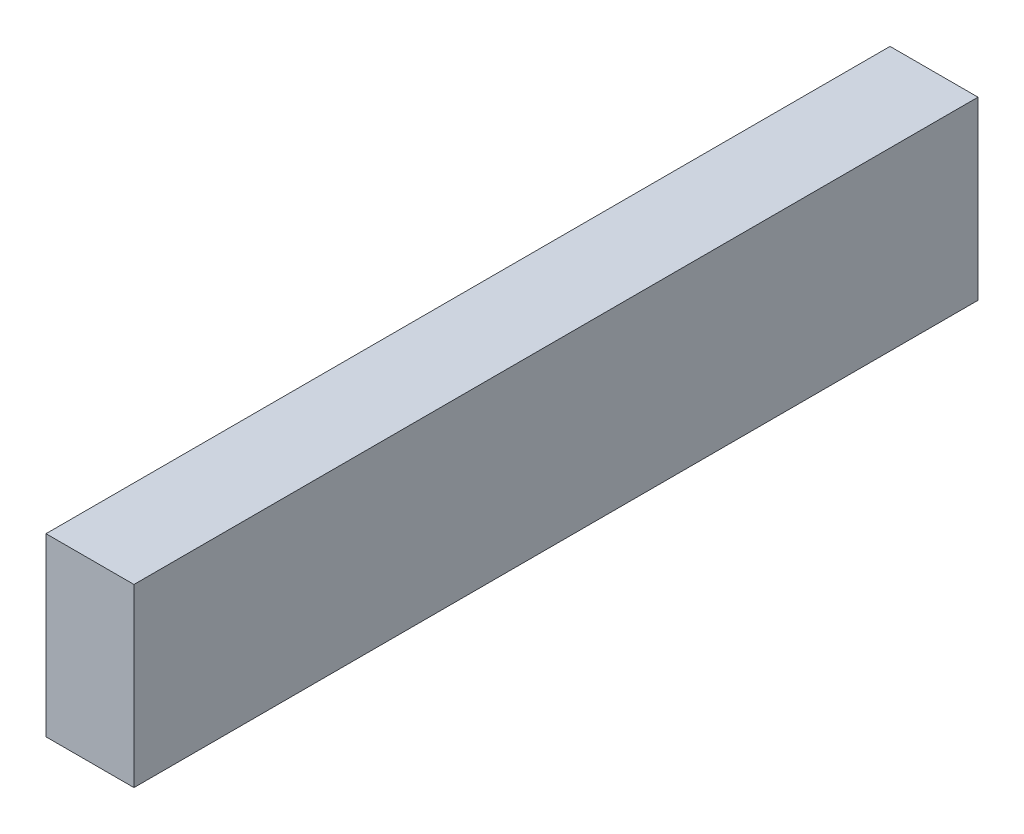
ISO-10303-21;
HEADER;
FILE_DESCRIPTION(('STEP AP214'),'2;1');
FILE_NAME('part.step','',(''),(''),'','','');
FILE_SCHEMA(('AUTOMOTIVE_DESIGN { 1 0 10303 214 1 1 1 1 }'));
ENDSEC;
DATA;
#1=APPLICATION_CONTEXT('core data for automotive mechanical design processes');
#2=APPLICATION_PROTOCOL_DEFINITION('international standard','automotive_design',2000,#1);
#3=PRODUCT_CONTEXT('',#1,'mechanical');
#4=PRODUCT('Part','Part','',(#3));
#5=PRODUCT_RELATED_PRODUCT_CATEGORY('part','',(#4));
#6=PRODUCT_DEFINITION_FORMATION('','',#4);
#7=PRODUCT_DEFINITION_CONTEXT('part definition',#1,'design');
#8=PRODUCT_DEFINITION('design','',#6,#7);
#9=PRODUCT_DEFINITION_SHAPE('','',#8);
#10=(LENGTH_UNIT() NAMED_UNIT(*) SI_UNIT(.MILLI.,.METRE.));
#11=(NAMED_UNIT(*) PLANE_ANGLE_UNIT() SI_UNIT($,.RADIAN.));
#12=(NAMED_UNIT(*) SI_UNIT($,.STERADIAN.) SOLID_ANGLE_UNIT());
#13=UNCERTAINTY_MEASURE_WITH_UNIT(LENGTH_MEASURE(1.E-05),#10,'distance_accuracy_value','');
#14=(GEOMETRIC_REPRESENTATION_CONTEXT(3) GLOBAL_UNCERTAINTY_ASSIGNED_CONTEXT((#13)) GLOBAL_UNIT_ASSIGNED_CONTEXT((#10,
#11,#12)) REPRESENTATION_CONTEXT('',''));
#15=CARTESIAN_POINT('',(0.,0.,0.));
#16=DIRECTION('',(0.,0.,1.));
#17=DIRECTION('',(1.,0.,0.));
#18=AXIS2_PLACEMENT_3D('',#15,#16,#17);
#19=CARTESIAN_POINT('',(19.05,28.2345614501132,39.709945146379));
#20=DIRECTION('',(0.,0.,-1.));
#21=DIRECTION('',(-1.,0.,0.));
#22=AXIS2_PLACEMENT_3D('',#19,#20,#21);
#23=PLANE('',#22);
#24=DIRECTION('',(0.,-1.,0.));
#25=VECTOR('',#24,1.);
#26=CARTESIAN_POINT('',(0.,28.2345614501132,39.709945146379));
#27=LINE('',#26,#25);
#28=CARTESIAN_POINT('',(0.,28.2345614501132,39.709945146379));
#29=VERTEX_POINT('',#28);
#30=CARTESIAN_POINT('',(0.,-9.86543854988684,39.709945146379));
#31=VERTEX_POINT('',#30);
#32=EDGE_CURVE('E107',#29,#31,#27,.T.);
#33=ORIENTED_EDGE('',*,*,#32,.T.);
#34=DIRECTION('',(-1.,0.,0.));
#35=VECTOR('',#34,1.);
#36=CARTESIAN_POINT('',(19.05,-9.86543854988684,39.709945146379));
#37=LINE('',#36,#35);
#38=CARTESIAN_POINT('',(19.05,-9.86543854988684,39.709945146379));
#39=VERTEX_POINT('',#38);
#40=EDGE_CURVE('E11',#39,#31,#37,.T.);
#41=ORIENTED_EDGE('',*,*,#40,.F.);
#42=DIRECTION('',(0.,-1.,0.));
#43=VECTOR('',#42,1.);
#44=CARTESIAN_POINT('',(19.05,28.2345614501132,39.709945146379));
#45=LINE('',#44,#43);
#46=CARTESIAN_POINT('',(19.05,28.2345614501132,39.709945146379));
#47=VERTEX_POINT('',#46);
#48=EDGE_CURVE('E91',#47,#39,#45,.T.);
#49=ORIENTED_EDGE('',*,*,#48,.F.);
#50=DIRECTION('',(-1.,0.,0.));
#51=VECTOR('',#50,1.);
#52=CARTESIAN_POINT('',(19.05,28.2345614501132,39.709945146379));
#53=LINE('',#52,#51);
#54=EDGE_CURVE('E103',#47,#29,#53,.T.);
#55=ORIENTED_EDGE('',*,*,#54,.T.);
#56=EDGE_LOOP('',(#33,#41,#49,#55));
#57=FACE_BOUND('',#56,.T.);
#58=ADVANCED_FACE('F39',(#57),#23,.F.);
#59=CARTESIAN_POINT('',(19.05,-9.86543854988684,39.709945146379));
#60=DIRECTION('',(0.,1.,0.));
#61=DIRECTION('',(0.,0.,1.));
#62=AXIS2_PLACEMENT_3D('',#59,#60,#61);
#63=PLANE('',#62);
#64=DIRECTION('',(0.,0.,-1.));
#65=VECTOR('',#64,1.);
#66=CARTESIAN_POINT('',(0.,-9.86543854988684,39.709945146379));
#67=LINE('',#66,#65);
#68=CARTESIAN_POINT('',(0.,-9.86543854988684,-143.068454853621));
#69=VERTEX_POINT('',#68);
#70=EDGE_CURVE('E96',#31,#69,#67,.T.);
#71=ORIENTED_EDGE('',*,*,#70,.T.);
#72=DIRECTION('',(-1.,0.,0.));
#73=VECTOR('',#72,1.);
#74=CARTESIAN_POINT('',(19.05,-9.86543854988684,-143.068454853621));
#75=LINE('',#74,#73);
#76=CARTESIAN_POINT('',(19.05,-9.86543854988684,-143.068454853621));
#77=VERTEX_POINT('',#76);
#78=EDGE_CURVE('E48',#77,#69,#75,.T.);
#79=ORIENTED_EDGE('',*,*,#78,.F.);
#80=DIRECTION('',(0.,0.,-1.));
#81=VECTOR('',#80,1.);
#82=CARTESIAN_POINT('',(19.05,-9.86543854988684,39.709945146379));
#83=LINE('',#82,#81);
#84=EDGE_CURVE('E86',#39,#77,#83,.T.);
#85=ORIENTED_EDGE('',*,*,#84,.F.);
#86=ORIENTED_EDGE('',*,*,#40,.T.);
#87=EDGE_LOOP('',(#71,#79,#85,#86));
#88=FACE_BOUND('',#87,.T.);
#89=ADVANCED_FACE('F95',(#88),#63,.F.);
#90=CARTESIAN_POINT('',(19.05,28.2345614501132,-143.068454853621));
#91=DIRECTION('',(0.,0.,1.));
#92=DIRECTION('',(1.,0.,0.));
#93=AXIS2_PLACEMENT_3D('',#90,#91,#92);
#94=PLANE('',#93);
#95=DIRECTION('',(0.,1.,0.));
#96=VECTOR('',#95,1.);
#97=CARTESIAN_POINT('',(0.,28.2345614501132,-143.068454853621));
#98=LINE('',#97,#96);
#99=CARTESIAN_POINT('',(0.,28.2345614501132,-143.068454853621));
#100=VERTEX_POINT('',#99);
#101=EDGE_CURVE('E73',#69,#100,#98,.T.);
#102=ORIENTED_EDGE('',*,*,#101,.T.);
#103=DIRECTION('',(-1.,0.,0.));
#104=VECTOR('',#103,1.);
#105=CARTESIAN_POINT('',(19.05,28.2345614501132,-143.068454853621));
#106=LINE('',#105,#104);
#107=CARTESIAN_POINT('',(19.05,28.2345614501132,-143.068454853621));
#108=VERTEX_POINT('',#107);
#109=EDGE_CURVE('E98',#108,#100,#106,.T.);
#110=ORIENTED_EDGE('',*,*,#109,.F.);
#111=DIRECTION('',(0.,1.,0.));
#112=VECTOR('',#111,1.);
#113=CARTESIAN_POINT('',(19.05,28.2345614501132,-143.068454853621));
#114=LINE('',#113,#112);
#115=EDGE_CURVE('E89',#77,#108,#114,.T.);
#116=ORIENTED_EDGE('',*,*,#115,.F.);
#117=ORIENTED_EDGE('',*,*,#78,.T.);
#118=EDGE_LOOP('',(#102,#110,#116,#117));
#119=FACE_BOUND('',#118,.T.);
#120=ADVANCED_FACE('F99',(#119),#94,.F.);
#121=CARTESIAN_POINT('',(19.05,28.2345614501132,39.709945146379));
#122=DIRECTION('',(0.,-1.,0.));
#123=DIRECTION('',(0.,0.,-1.));
#124=AXIS2_PLACEMENT_3D('',#121,#122,#123);
#125=PLANE('',#124);
#126=DIRECTION('',(0.,0.,1.));
#127=VECTOR('',#126,1.);
#128=CARTESIAN_POINT('',(0.,28.2345614501132,39.709945146379));
#129=LINE('',#128,#127);
#130=EDGE_CURVE('E79',#100,#29,#129,.T.);
#131=ORIENTED_EDGE('',*,*,#130,.T.);
#132=ORIENTED_EDGE('',*,*,#54,.F.);
#133=DIRECTION('',(0.,0.,1.));
#134=VECTOR('',#133,1.);
#135=CARTESIAN_POINT('',(19.05,28.2345614501132,39.709945146379));
#136=LINE('',#135,#134);
#137=EDGE_CURVE('E56',#108,#47,#136,.T.);
#138=ORIENTED_EDGE('',*,*,#137,.F.);
#139=ORIENTED_EDGE('',*,*,#109,.T.);
#140=EDGE_LOOP('',(#131,#132,#138,#139));
#141=FACE_BOUND('',#140,.T.);
#142=ADVANCED_FACE('F120',(#141),#125,.F.);
#143=CARTESIAN_POINT('',(19.05,0.,0.));
#144=DIRECTION('',(1.,0.,0.));
#145=DIRECTION('',(0.,0.,-1.));
#146=AXIS2_PLACEMENT_3D('',#143,#144,#145);
#147=PLANE('',#146);
#148=ORIENTED_EDGE('',*,*,#48,.T.);
#149=ORIENTED_EDGE('',*,*,#84,.T.);
#150=ORIENTED_EDGE('',*,*,#115,.T.);
#151=ORIENTED_EDGE('',*,*,#137,.T.);
#152=EDGE_LOOP('',(#148,#149,#150,#151));
#153=FACE_BOUND('',#152,.T.);
#154=ADVANCED_FACE('F87',(#153),#147,.T.);
#155=CARTESIAN_POINT('',(0.,0.,0.));
#156=DIRECTION('',(1.,0.,0.));
#157=DIRECTION('',(0.,0.,-1.));
#158=AXIS2_PLACEMENT_3D('',#155,#156,#157);
#159=PLANE('',#158);
#160=ORIENTED_EDGE('',*,*,#32,.F.);
#161=ORIENTED_EDGE('',*,*,#130,.F.);
#162=ORIENTED_EDGE('',*,*,#101,.F.);
#163=ORIENTED_EDGE('',*,*,#70,.F.);
#164=EDGE_LOOP('',(#160,#161,#162,#163));
#165=FACE_BOUND('',#164,.T.);
#166=ADVANCED_FACE('F123',(#165),#159,.F.);
#167=CLOSED_SHELL('',(#58,#89,#120,#142,#154,#166));
#168=MANIFOLD_SOLID_BREP('B2',#167);
#169=ADVANCED_BREP_SHAPE_REPRESENTATION('',(#18,#168),#14);
#170=SHAPE_DEFINITION_REPRESENTATION(#9,#169);
ENDSEC;
END-ISO-10303-21;
